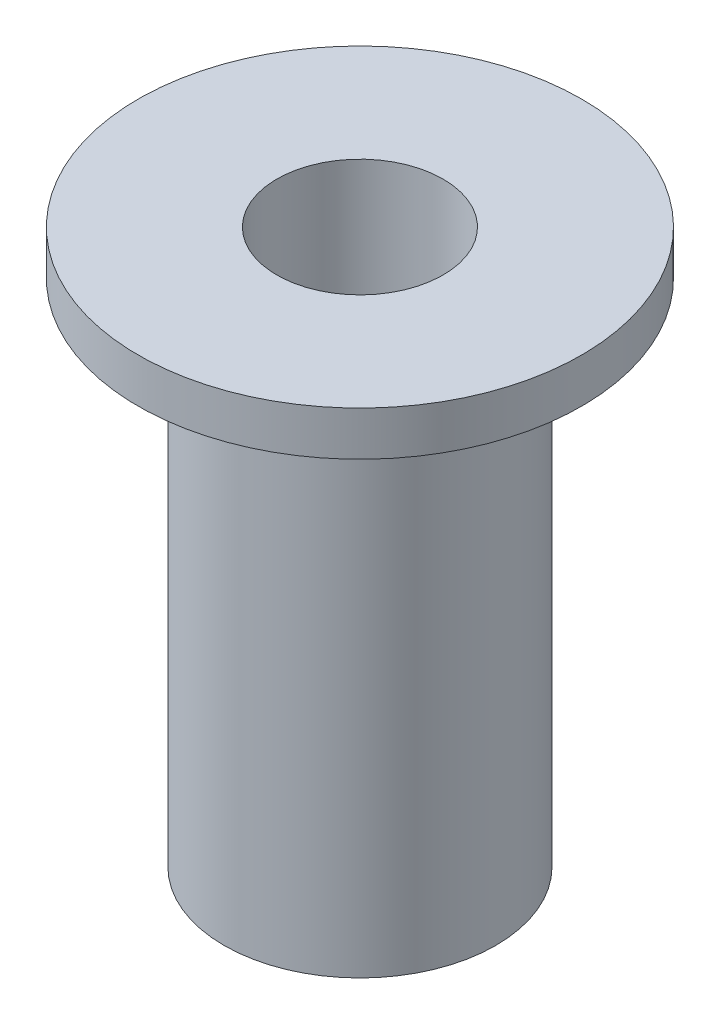
ISO-10303-21;
HEADER;
FILE_DESCRIPTION(('STEP AP214'),'2;1');
FILE_NAME('part.step','',(''),(''),'','','');
FILE_SCHEMA(('AUTOMOTIVE_DESIGN { 1 0 10303 214 1 1 1 1 }'));
ENDSEC;
DATA;
#1=APPLICATION_CONTEXT('core data for automotive mechanical design processes');
#2=APPLICATION_PROTOCOL_DEFINITION('international standard','automotive_design',2000,#1);
#3=PRODUCT_CONTEXT('',#1,'mechanical');
#4=PRODUCT('Part','Part','',(#3));
#5=PRODUCT_RELATED_PRODUCT_CATEGORY('part','',(#4));
#6=PRODUCT_DEFINITION_FORMATION('','',#4);
#7=PRODUCT_DEFINITION_CONTEXT('part definition',#1,'design');
#8=PRODUCT_DEFINITION('design','',#6,#7);
#9=PRODUCT_DEFINITION_SHAPE('','',#8);
#10=(LENGTH_UNIT() NAMED_UNIT(*) SI_UNIT(.MILLI.,.METRE.));
#11=(NAMED_UNIT(*) PLANE_ANGLE_UNIT() SI_UNIT($,.RADIAN.));
#12=(NAMED_UNIT(*) SI_UNIT($,.STERADIAN.) SOLID_ANGLE_UNIT());
#13=UNCERTAINTY_MEASURE_WITH_UNIT(LENGTH_MEASURE(1.E-05),#10,'distance_accuracy_value','');
#14=(GEOMETRIC_REPRESENTATION_CONTEXT(3) GLOBAL_UNCERTAINTY_ASSIGNED_CONTEXT((#13)) GLOBAL_UNIT_ASSIGNED_CONTEXT((#10,
#11,#12)) REPRESENTATION_CONTEXT('',''));
#15=CARTESIAN_POINT('',(0.,0.,0.));
#16=DIRECTION('',(0.,0.,1.));
#17=DIRECTION('',(1.,0.,0.));
#18=AXIS2_PLACEMENT_3D('',#15,#16,#17);
#19=CARTESIAN_POINT('',(0.,0.,0.));
#20=DIRECTION('',(0.,-1.,0.));
#21=DIRECTION('',(0.,0.,-1.));
#22=AXIS2_PLACEMENT_3D('',#19,#20,#21);
#23=CYLINDRICAL_SURFACE('',#22,4.);
#24=CARTESIAN_POINT('',(0.,10.,0.));
#25=DIRECTION('',(0.,-1.,0.));
#26=DIRECTION('',(0.,0.,-1.));
#27=AXIS2_PLACEMENT_3D('',#24,#25,#26);
#28=CIRCLE('',#27,4.);
#29=CARTESIAN_POINT('',(0.,10.,-4.));
#30=VERTEX_POINT('',#29);
#31=EDGE_CURVE('E10',#30,#30,#28,.T.);
#32=ORIENTED_EDGE('',*,*,#31,.T.);
#33=EDGE_LOOP('',(#32));
#34=FACE_BOUND('',#33,.T.);
#35=CARTESIAN_POINT('',(0.,9.2,0.));
#36=DIRECTION('',(0.,-1.,0.));
#37=DIRECTION('',(0.,0.,-1.));
#38=AXIS2_PLACEMENT_3D('',#35,#36,#37);
#39=CIRCLE('',#38,4.);
#40=CARTESIAN_POINT('',(0.,9.2,-4.));
#41=VERTEX_POINT('',#40);
#42=EDGE_CURVE('E52',#41,#41,#39,.T.);
#43=ORIENTED_EDGE('',*,*,#42,.F.);
#44=EDGE_LOOP('',(#43));
#45=FACE_BOUND('',#44,.T.);
#46=ADVANCED_FACE('F30',(#34,#45),#23,.T.);
#47=CARTESIAN_POINT('',(4.,10.,0.));
#48=DIRECTION('',(0.,1.,0.));
#49=DIRECTION('',(0.,0.,1.));
#50=AXIS2_PLACEMENT_3D('',#47,#48,#49);
#51=PLANE('',#50);
#52=CARTESIAN_POINT('',(0.,10.,0.));
#53=DIRECTION('',(0.,-1.,0.));
#54=DIRECTION('',(0.,0.,-1.));
#55=AXIS2_PLACEMENT_3D('',#52,#53,#54);
#56=CIRCLE('',#55,1.5);
#57=CARTESIAN_POINT('',(0.,10.,-1.5));
#58=VERTEX_POINT('',#57);
#59=EDGE_CURVE('E36',#58,#58,#56,.T.);
#60=ORIENTED_EDGE('',*,*,#59,.T.);
#61=EDGE_LOOP('',(#60));
#62=FACE_BOUND('',#61,.T.);
#63=ORIENTED_EDGE('',*,*,#31,.F.);
#64=EDGE_LOOP('',(#63));
#65=FACE_BOUND('',#64,.T.);
#66=ADVANCED_FACE('F60',(#62,#65),#51,.T.);
#67=CARTESIAN_POINT('',(0.,0.,0.));
#68=DIRECTION('',(0.,-1.,0.));
#69=DIRECTION('',(0.,0.,-1.));
#70=AXIS2_PLACEMENT_3D('',#67,#68,#69);
#71=CYLINDRICAL_SURFACE('',#70,1.5);
#72=CARTESIAN_POINT('',(0.,0.,0.));
#73=DIRECTION('',(0.,-1.,0.));
#74=DIRECTION('',(0.,0.,-1.));
#75=AXIS2_PLACEMENT_3D('',#72,#73,#74);
#76=CIRCLE('',#75,1.5);
#77=CARTESIAN_POINT('',(0.,0.,-1.5));
#78=VERTEX_POINT('',#77);
#79=EDGE_CURVE('E40',#78,#78,#76,.T.);
#80=ORIENTED_EDGE('',*,*,#79,.T.);
#81=EDGE_LOOP('',(#80));
#82=FACE_BOUND('',#81,.T.);
#83=ORIENTED_EDGE('',*,*,#59,.F.);
#84=EDGE_LOOP('',(#83));
#85=FACE_BOUND('',#84,.T.);
#86=ADVANCED_FACE('F64',(#82,#85),#71,.F.);
#87=CARTESIAN_POINT('',(1.5,0.,0.));
#88=DIRECTION('',(0.,-1.,0.));
#89=DIRECTION('',(0.,0.,-1.));
#90=AXIS2_PLACEMENT_3D('',#87,#88,#89);
#91=PLANE('',#90);
#92=CARTESIAN_POINT('',(0.,0.,0.));
#93=DIRECTION('',(0.,-1.,0.));
#94=DIRECTION('',(0.,0.,-1.));
#95=AXIS2_PLACEMENT_3D('',#92,#93,#94);
#96=CIRCLE('',#95,2.45);
#97=CARTESIAN_POINT('',(0.,0.,-2.45));
#98=VERTEX_POINT('',#97);
#99=EDGE_CURVE('E44',#98,#98,#96,.T.);
#100=ORIENTED_EDGE('',*,*,#99,.T.);
#101=EDGE_LOOP('',(#100));
#102=FACE_BOUND('',#101,.T.);
#103=ORIENTED_EDGE('',*,*,#79,.F.);
#104=EDGE_LOOP('',(#103));
#105=FACE_BOUND('',#104,.T.);
#106=ADVANCED_FACE('F68',(#102,#105),#91,.T.);
#107=CARTESIAN_POINT('',(0.,0.,0.));
#108=DIRECTION('',(0.,-1.,0.));
#109=DIRECTION('',(0.,0.,-1.));
#110=AXIS2_PLACEMENT_3D('',#107,#108,#109);
#111=CYLINDRICAL_SURFACE('',#110,2.45);
#112=CARTESIAN_POINT('',(0.,9.2,0.));
#113=DIRECTION('',(0.,-1.,0.));
#114=DIRECTION('',(0.,0.,-1.));
#115=AXIS2_PLACEMENT_3D('',#112,#113,#114);
#116=CIRCLE('',#115,2.45);
#117=CARTESIAN_POINT('',(0.,9.2,-2.45));
#118=VERTEX_POINT('',#117);
#119=EDGE_CURVE('E49',#118,#118,#116,.T.);
#120=ORIENTED_EDGE('',*,*,#119,.T.);
#121=EDGE_LOOP('',(#120));
#122=FACE_BOUND('',#121,.T.);
#123=ORIENTED_EDGE('',*,*,#99,.F.);
#124=EDGE_LOOP('',(#123));
#125=FACE_BOUND('',#124,.T.);
#126=ADVANCED_FACE('F75',(#122,#125),#111,.T.);
#127=CARTESIAN_POINT('',(2.45,9.2,0.));
#128=DIRECTION('',(0.,-1.,0.));
#129=DIRECTION('',(0.,0.,-1.));
#130=AXIS2_PLACEMENT_3D('',#127,#128,#129);
#131=PLANE('',#130);
#132=ORIENTED_EDGE('',*,*,#42,.T.);
#133=EDGE_LOOP('',(#132));
#134=FACE_BOUND('',#133,.T.);
#135=ORIENTED_EDGE('',*,*,#119,.F.);
#136=EDGE_LOOP('',(#135));
#137=FACE_BOUND('',#136,.T.);
#138=ADVANCED_FACE('F56',(#134,#137),#131,.T.);
#139=CLOSED_SHELL('',(#46,#66,#86,#106,#126,#138));
#140=MANIFOLD_SOLID_BREP('B2',#139);
#141=ADVANCED_BREP_SHAPE_REPRESENTATION('',(#18,#140),#14);
#142=SHAPE_DEFINITION_REPRESENTATION(#9,#141);
ENDSEC;
END-ISO-10303-21;
